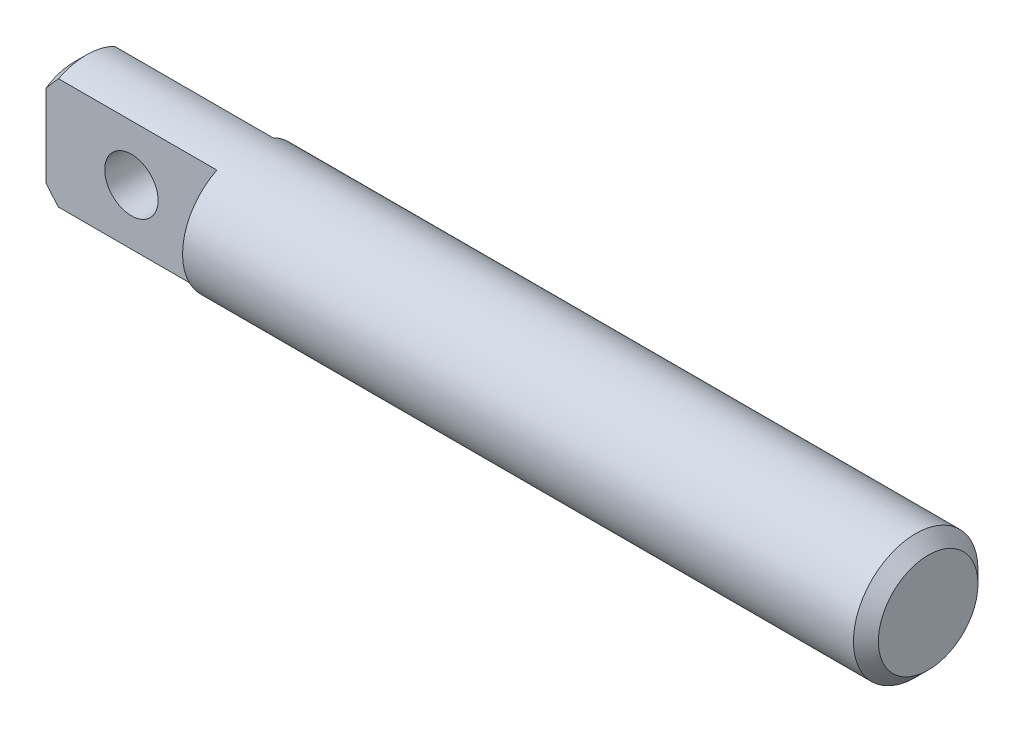
ISO-10303-21;
HEADER;
FILE_DESCRIPTION(('STEP AP214'),'2;1');
FILE_NAME('part.step','',(''),(''),'','','');
FILE_SCHEMA(('AUTOMOTIVE_DESIGN { 1 0 10303 214 1 1 1 1 }'));
ENDSEC;
DATA;
#1=APPLICATION_CONTEXT('core data for automotive mechanical design processes');
#2=APPLICATION_PROTOCOL_DEFINITION('international standard','automotive_design',2000,#1);
#3=PRODUCT_CONTEXT('',#1,'mechanical');
#4=PRODUCT('Part','Part','',(#3));
#5=PRODUCT_RELATED_PRODUCT_CATEGORY('part','',(#4));
#6=PRODUCT_DEFINITION_FORMATION('','',#4);
#7=PRODUCT_DEFINITION_CONTEXT('part definition',#1,'design');
#8=PRODUCT_DEFINITION('design','',#6,#7);
#9=PRODUCT_DEFINITION_SHAPE('','',#8);
#10=(LENGTH_UNIT() NAMED_UNIT(*) SI_UNIT(.MILLI.,.METRE.));
#11=(NAMED_UNIT(*) PLANE_ANGLE_UNIT() SI_UNIT($,.RADIAN.));
#12=(NAMED_UNIT(*) SI_UNIT($,.STERADIAN.) SOLID_ANGLE_UNIT());
#13=UNCERTAINTY_MEASURE_WITH_UNIT(LENGTH_MEASURE(1.E-05),#10,'distance_accuracy_value','');
#14=(GEOMETRIC_REPRESENTATION_CONTEXT(3) GLOBAL_UNCERTAINTY_ASSIGNED_CONTEXT((#13)) GLOBAL_UNIT_ASSIGNED_CONTEXT((#10,
#11,#12)) REPRESENTATION_CONTEXT('',''));
#15=CARTESIAN_POINT('',(0.,0.,0.));
#16=DIRECTION('',(0.,0.,1.));
#17=DIRECTION('',(1.,0.,0.));
#18=AXIS2_PLACEMENT_3D('',#15,#16,#17);
#19=CARTESIAN_POINT('',(-19.05,0.,0.));
#20=DIRECTION('',(1.,0.,0.));
#21=DIRECTION('',(0.,0.,-1.));
#22=AXIS2_PLACEMENT_3D('',#19,#20,#21);
#23=CYLINDRICAL_SURFACE('',#22,2.778125);
#24=DIRECTION('',(1.,0.,0.));
#25=VECTOR('',#24,1.);
#26=CARTESIAN_POINT('',(-19.05,-2.48094495428878,-1.25015625));
#27=LINE('',#26,#25);
#28=CARTESIAN_POINT('',(-11.43,-2.48094495428878,-1.25015625));
#29=VERTEX_POINT('',#28);
#30=CARTESIAN_POINT('',(-18.494375,-2.48094495428879,-1.25015625));
#31=VERTEX_POINT('',#30);
#32=EDGE_CURVE('E153',#29,#31,#27,.F.);
#33=ORIENTED_EDGE('',*,*,#32,.F.);
#34=CARTESIAN_POINT('',(-11.43,0.,0.));
#35=DIRECTION('',(-1.,0.,0.));
#36=DIRECTION('',(0.,0.,1.));
#37=AXIS2_PLACEMENT_3D('',#34,#35,#36);
#38=CIRCLE('',#37,2.778125);
#39=CARTESIAN_POINT('',(-11.43,2.48094495428878,-1.25015625));
#40=VERTEX_POINT('',#39);
#41=EDGE_CURVE('E11',#29,#40,#38,.F.);
#42=ORIENTED_EDGE('',*,*,#41,.T.);
#43=DIRECTION('',(1.,0.,0.));
#44=VECTOR('',#43,1.);
#45=CARTESIAN_POINT('',(-19.05,2.48094495428878,-1.25015625));
#46=LINE('',#45,#44);
#47=CARTESIAN_POINT('',(-18.494375,2.48094495428878,-1.25015625));
#48=VERTEX_POINT('',#47);
#49=EDGE_CURVE('E156',#48,#40,#46,.T.);
#50=ORIENTED_EDGE('',*,*,#49,.F.);
#51=CARTESIAN_POINT('',(-18.494375,0.,0.));
#52=DIRECTION('',(1.,0.,0.));
#53=DIRECTION('',(0.,0.,-1.));
#54=AXIS2_PLACEMENT_3D('',#51,#52,#53);
#55=CIRCLE('',#54,2.778125);
#56=CARTESIAN_POINT('',(-18.494375,2.48094495428878,1.25015625));
#57=VERTEX_POINT('',#56);
#58=EDGE_CURVE('E155',#48,#57,#55,.T.);
#59=ORIENTED_EDGE('',*,*,#58,.T.);
#60=DIRECTION('',(1.,0.,0.));
#61=VECTOR('',#60,1.);
#62=CARTESIAN_POINT('',(-19.05,2.48094495428878,1.25015625));
#63=LINE('',#62,#61);
#64=CARTESIAN_POINT('',(-11.43,2.48094495428878,1.25015625));
#65=VERTEX_POINT('',#64);
#66=EDGE_CURVE('E50',#57,#65,#63,.T.);
#67=ORIENTED_EDGE('',*,*,#66,.T.);
#68=CARTESIAN_POINT('',(-11.43,0.,0.));
#69=DIRECTION('',(-1.,0.,0.));
#70=DIRECTION('',(0.,0.,1.));
#71=AXIS2_PLACEMENT_3D('',#68,#69,#70);
#72=CIRCLE('',#71,2.778125);
#73=CARTESIAN_POINT('',(-11.43,-2.48094495428878,1.25015625));
#74=VERTEX_POINT('',#73);
#75=EDGE_CURVE('E43',#65,#74,#72,.F.);
#76=ORIENTED_EDGE('',*,*,#75,.T.);
#77=DIRECTION('',(1.,0.,0.));
#78=VECTOR('',#77,1.);
#79=CARTESIAN_POINT('',(-19.05,-2.48094495428878,1.25015625));
#80=LINE('',#79,#78);
#81=CARTESIAN_POINT('',(-18.494375,-2.48094495428879,1.25015625));
#82=VERTEX_POINT('',#81);
#83=EDGE_CURVE('E167',#74,#82,#80,.F.);
#84=ORIENTED_EDGE('',*,*,#83,.T.);
#85=EDGE_CURVE('E105',#82,#31,#55,.T.);
#86=ORIENTED_EDGE('',*,*,#85,.T.);
#87=EDGE_LOOP('',(#33,#42,#50,#59,#67,#76,#84,#86));
#88=FACE_BOUND('',#87,.T.);
#89=CARTESIAN_POINT('',(18.494375,0.,0.));
#90=DIRECTION('',(1.,0.,0.));
#91=DIRECTION('',(0.,0.,-1.));
#92=AXIS2_PLACEMENT_3D('',#89,#90,#91);
#93=CIRCLE('',#92,2.778125);
#94=CARTESIAN_POINT('',(18.494375,0.,-2.778125));
#95=VERTEX_POINT('',#94);
#96=EDGE_CURVE('E111',#95,#95,#93,.F.);
#97=ORIENTED_EDGE('',*,*,#96,.T.);
#98=EDGE_LOOP('',(#97));
#99=FACE_BOUND('',#98,.T.);
#100=ADVANCED_FACE('F33',(#88,#99),#23,.T.);
#101=CARTESIAN_POINT('',(-19.05,0.,0.));
#102=DIRECTION('',(1.,0.,0.));
#103=DIRECTION('',(0.,0.,-1.));
#104=AXIS2_PLACEMENT_3D('',#101,#102,#103);
#105=PLANE('',#104);
#106=CARTESIAN_POINT('',(-19.05,0.,0.));
#107=DIRECTION('',(1.,0.,0.));
#108=DIRECTION('',(0.,0.,-1.));
#109=AXIS2_PLACEMENT_3D('',#106,#107,#108);
#110=CIRCLE('',#109,2.22249999999998);
#111=CARTESIAN_POINT('',(-19.05,1.83755696526281,1.25015625));
#112=VERTEX_POINT('',#111);
#113=CARTESIAN_POINT('',(-19.05,1.83755696526281,-1.25015625));
#114=VERTEX_POINT('',#113);
#115=EDGE_CURVE('E109',#112,#114,#110,.F.);
#116=ORIENTED_EDGE('',*,*,#115,.T.);
#117=DIRECTION('',(0.,1.,0.));
#118=VECTOR('',#117,1.);
#119=CARTESIAN_POINT('',(-19.05,0.,-1.25015625));
#120=LINE('',#119,#118);
#121=CARTESIAN_POINT('',(-19.05,-1.83755696526281,-1.25015625));
#122=VERTEX_POINT('',#121);
#123=EDGE_CURVE('E58',#122,#114,#120,.T.);
#124=ORIENTED_EDGE('',*,*,#123,.F.);
#125=CARTESIAN_POINT('',(-19.05,-1.83755696526281,1.25015625));
#126=VERTEX_POINT('',#125);
#127=EDGE_CURVE('E103',#122,#126,#110,.F.);
#128=ORIENTED_EDGE('',*,*,#127,.T.);
#129=DIRECTION('',(0.,1.,0.));
#130=VECTOR('',#129,1.);
#131=CARTESIAN_POINT('',(-19.05,0.,1.25015625));
#132=LINE('',#131,#130);
#133=EDGE_CURVE('E87',#126,#112,#132,.T.);
#134=ORIENTED_EDGE('',*,*,#133,.T.);
#135=EDGE_LOOP('',(#116,#124,#128,#134));
#136=FACE_BOUND('',#135,.T.);
#137=ADVANCED_FACE('F108',(#136),#105,.F.);
#138=CARTESIAN_POINT('',(-18.494375,0.,0.));
#139=DIRECTION('',(1.,0.,0.));
#140=DIRECTION('',(0.,0.,-1.));
#141=AXIS2_PLACEMENT_3D('',#138,#139,#140);
#142=CONICAL_SURFACE('',#141,2.778125,0.785398163397453);
#143=CARTESIAN_POINT('',(-15.1437977148088,-5.99984175217095,-1.25015625));
#144=CARTESIAN_POINT('',(-15.2862790397768,-5.85429341591392,-1.25015625));
#145=CARTESIAN_POINT('',(-15.4286569081589,-5.70864354358459,-1.25015625));
#146=CARTESIAN_POINT('',(-15.7133798471582,-5.41682311170151,-1.25015625));
#147=CARTESIAN_POINT('',(-15.8557244414768,-5.2706520875071,-1.25015625));
#148=CARTESIAN_POINT('',(-16.1441879023591,-4.97372743920858,-1.25015625));
#149=CARTESIAN_POINT('',(-16.2902965137751,-4.8229638471388,-1.25015625));
#150=CARTESIAN_POINT('',(-16.5817765782508,-4.52122966327245,-1.25015625));
#151=CARTESIAN_POINT('',(-16.7271488696072,-4.37025988175388,-1.25015625));
#152=CARTESIAN_POINT('',(-17.0102394325332,-4.07500301138778,-1.25015625));
#153=CARTESIAN_POINT('',(-17.1479883031171,-3.93074528572952,-1.25015625));
#154=CARTESIAN_POINT('',(-17.4227104806121,-3.64143519891799,-1.25015625));
#155=CARTESIAN_POINT('',(-17.5596836195039,-3.49638267806704,-1.25015625));
#156=CARTESIAN_POINT('',(-17.8334588422059,-3.2041772952479,-1.25015625));
#157=CARTESIAN_POINT('',(-17.970252834978,-3.05701683352406,-1.25015625));
#158=CARTESIAN_POINT('',(-18.2420079038534,-2.76123238386521,-1.25015625));
#159=CARTESIAN_POINT('',(-18.376970387001,-2.61260969076958,-1.25015625));
#160=CARTESIAN_POINT('',(-18.6404909687136,-2.31710841938801,-1.25015625));
#161=CARTESIAN_POINT('',(-18.7691228070271,-2.17029620285472,-1.25015625));
#162=CARTESIAN_POINT('',(-18.958991879474,-1.94703321520391,-1.25015625));
#163=CARTESIAN_POINT('',(-19.0218685949695,-1.87197972146568,-1.25015625));
#164=CARTESIAN_POINT('',(-19.1460946981215,-1.72063600139797,-1.25015625));
#165=CARTESIAN_POINT('',(-19.2074443586556,-1.6443460001086,-1.25015625));
#166=CARTESIAN_POINT('',(-19.3271859456586,-1.49117674078092,-1.25015625));
#167=CARTESIAN_POINT('',(-19.3856071713808,-1.41432050044305,-1.25015625));
#168=CARTESIAN_POINT('',(-19.4995175988745,-1.25834186429071,-1.25015625));
#169=CARTESIAN_POINT('',(-19.5550043645846,-1.17921766719504,-1.25015625));
#170=CARTESIAN_POINT('',(-19.6611610400663,-1.01841222035611,-1.25015625));
#171=CARTESIAN_POINT('',(-19.7118561804126,-0.936747768361951,-1.25015625));
#172=CARTESIAN_POINT('',(-19.806150099985,-0.769455143806472,-1.25015625));
#173=CARTESIAN_POINT('',(-19.8497630949186,-0.683835365976064,-1.25015625));
#174=CARTESIAN_POINT('',(-19.8957672588276,-0.576878558230866,-1.25015625));
#175=CARTESIAN_POINT('',(-19.9036265446968,-0.557880759553825,-1.25015625));
#176=CARTESIAN_POINT('',(-19.918760727707,-0.519643009487904,-1.25015625));
#177=CARTESIAN_POINT('',(-19.9260353626574,-0.500402953881722,-1.25015625));
#178=CARTESIAN_POINT('',(-19.9399371557106,-0.461691454042766,-1.25015625));
#179=CARTESIAN_POINT('',(-19.9465643758775,-0.442220032190954,-1.25015625));
#180=CARTESIAN_POINT('',(-19.9591085731604,-0.403051926716749,-1.25015625));
#181=CARTESIAN_POINT('',(-19.965025594537,-0.383355257216007,-1.25015625));
#182=CARTESIAN_POINT('',(-19.981425267693,-0.324621057239181,-1.25015625));
#183=CARTESIAN_POINT('',(-19.9908024126451,-0.285265065126734,-1.25015625));
#184=CARTESIAN_POINT('',(-20.0061053904782,-0.2058675538485,-1.25015625));
#185=CARTESIAN_POINT('',(-20.0120301010957,-0.165825816120396,-1.25015625));
#186=CARTESIAN_POINT('',(-20.0201450334091,-0.084627109268307,-1.25015625));
#187=CARTESIAN_POINT('',(-20.0222659828596,-0.0434630504423657,-1.25015625));
#188=CARTESIAN_POINT('',(-20.0224172797187,0.0388598101314496,-1.25015625));
#189=CARTESIAN_POINT('',(-20.0204488451366,0.0800186097941777,-1.25015625));
#190=CARTESIAN_POINT('',(-20.0125462752103,0.162068023197748,-1.25015625));
#191=CARTESIAN_POINT('',(-20.0066006152202,0.202957507836205,-1.25015625));
#192=CARTESIAN_POINT('',(-19.991098623638,0.284052320262391,-1.25015625));
#193=CARTESIAN_POINT('',(-19.9815405492558,0.324257308018596,-1.25015625));
#194=CARTESIAN_POINT('',(-19.9546722598038,0.420364591255218,-1.25015625));
#195=CARTESIAN_POINT('',(-19.9357913949926,0.475825653001581,-1.25015625));
#196=CARTESIAN_POINT('',(-19.8932175764483,0.584855581286207,-1.25015625));
#197=CARTESIAN_POINT('',(-19.8695216270469,0.6384232453862,-1.25015625));
#198=CARTESIAN_POINT('',(-19.8183892077121,0.744109202664803,-1.25015625));
#199=CARTESIAN_POINT('',(-19.7909315083344,0.796217088746848,-1.25015625));
#200=CARTESIAN_POINT('',(-19.7333213733352,0.898878942875087,-1.25015625));
#201=CARTESIAN_POINT('',(-19.7031698995371,0.949433456963053,-1.25015625));
#202=CARTESIAN_POINT('',(-19.635813397061,1.05731038681466,-1.25015625));
#203=CARTESIAN_POINT('',(-19.5982546995845,1.1144105898051,-1.25015625));
#204=CARTESIAN_POINT('',(-19.5211229428566,1.22723966939193,-1.25015625));
#205=CARTESIAN_POINT('',(-19.4815494564534,1.28296825144709,-1.25015625));
#206=CARTESIAN_POINT('',(-19.3605371441772,1.44860273563552,-1.25015625));
#207=CARTESIAN_POINT('',(-19.2768631866064,1.55687024026319,-1.25015625));
#208=CARTESIAN_POINT('',(-19.1057754149176,1.77084512635414,-1.25015625));
#209=CARTESIAN_POINT('',(-19.0183520323055,1.87654472875925,-1.25015625));
#210=CARTESIAN_POINT('',(-18.841251456036,2.08595169134478,-1.25015625));
#211=CARTESIAN_POINT('',(-18.7515752904604,2.18965992350916,-1.25015625));
#212=CARTESIAN_POINT('',(-18.570404053475,2.39601147257986,-1.25015625));
#213=CARTESIAN_POINT('',(-18.478904396156,2.49865074475845,-1.25015625));
#214=CARTESIAN_POINT('',(-18.2947821113364,2.70293524694739,-1.25015625));
#215=CARTESIAN_POINT('',(-18.2021593632441,2.80458036805578,-1.25015625));
#216=CARTESIAN_POINT('',(-17.9233794828847,3.1080820552544,-1.25015625));
#217=CARTESIAN_POINT('',(-17.7360195386316,3.30883223760984,-1.25015625));
#218=CARTESIAN_POINT('',(-17.3489814390613,3.71968317041704,-1.25015625));
#219=CARTESIAN_POINT('',(-17.1491973269104,3.92968361954701,-1.25015625));
#220=CARTESIAN_POINT('',(-16.7482215870087,4.34854662780243,-1.25015625));
#221=CARTESIAN_POINT('',(-16.5470292751478,4.55740853139365,-1.25015625));
#222=CARTESIAN_POINT('',(-16.1457714594881,4.97224350221268,-1.25015625));
#223=CARTESIAN_POINT('',(-15.9457144004864,5.17822474993588,-1.25015625));
#224=CARTESIAN_POINT('',(-15.545100037006,5.58947955576443,-1.25015625));
#225=CARTESIAN_POINT('',(-15.3445430684227,5.79475344095209,-1.25015625));
#226=CARTESIAN_POINT('',(-15.1437977148088,5.99984175217096,-1.25015625));
#227=B_SPLINE_CURVE_WITH_KNOTS('',3,(#143,#144,#145,#146,#147,#148,#149,#150,#151,#152,#153,
#154,#155,#156,#157,#158,#159,#160,#161,#162,#163,#164,#165,#166,#167,#168,#169,#170,#171,#172,
#173,#174,#175,#176,#177,#178,#179,#180,#181,#182,#183,#184,#185,#186,#187,#188,#189,#190,#191,
#192,#193,#194,#195,#196,#197,#198,#199,#200,#201,#202,#203,#204,#205,#206,#207,#208,#209,#210,
#211,#212,#213,#214,#215,#216,#217,#218,#219,#220,#221,#222,#223,#224,#225,#226),.UNSPECIFIED.,
.F.,.F.,(4,2,2,2,2,2,2,2,2,2,2,2,2,2,2,2,2,2,2,2,2,2,2,2,2,2,2,2,2,2,2,2,2,2,2,2,2,2,2,2,2,4),
(0.,0.611038043473178,1.22312552284303,1.85296316203927,2.4817103627987,3.08009374155775,
3.67860211739569,4.28135190018361,4.88360891435237,5.46912442312643,5.76284295974228,
6.05650862783671,6.34608292004141,6.63589394769863,6.92408229288897,7.21168482090683,
7.27335488653124,7.33505245595278,7.39674410494345,7.4584319072204,7.57965979426724,
7.70092706623351,7.82438119869177,7.94779856602356,8.07157511302299,8.1954114517396,
8.37085840481207,8.54641484691382,8.72300632278922,8.89953499602617,9.10451114724297,
9.30953093754362,9.71988193913639,10.1313509868088,10.5426355502399,10.9551335764975,
11.3676762938872,12.1914477094953,13.0609955197722,13.9310000094643,14.7924276980098,
15.6533813105829),.UNSPECIFIED.);
#228=EDGE_CURVE('E166',#31,#122,#227,.T.);
#229=ORIENTED_EDGE('',*,*,#228,.F.);
#230=ORIENTED_EDGE('',*,*,#85,.F.);
#231=CARTESIAN_POINT('',(-15.1437977148088,-5.99984175217096,1.25015625));
#232=CARTESIAN_POINT('',(-15.2862790397768,-5.85429341591392,1.25015625));
#233=CARTESIAN_POINT('',(-15.4286569081589,-5.70864354358459,1.25015625));
#234=CARTESIAN_POINT('',(-15.7133798471582,-5.41682311170151,1.25015625));
#235=CARTESIAN_POINT('',(-15.8557244414768,-5.2706520875071,1.25015625));
#236=CARTESIAN_POINT('',(-16.1441879023591,-4.97372743920858,1.25015625));
#237=CARTESIAN_POINT('',(-16.2902965137751,-4.8229638471388,1.25015625));
#238=CARTESIAN_POINT('',(-16.5817765782508,-4.52122966327245,1.25015625));
#239=CARTESIAN_POINT('',(-16.7271488696072,-4.37025988175388,1.25015625));
#240=CARTESIAN_POINT('',(-17.0102394325332,-4.07500301138778,1.25015625));
#241=CARTESIAN_POINT('',(-17.1479883031171,-3.93074528572952,1.25015625));
#242=CARTESIAN_POINT('',(-17.4227104806121,-3.64143519891799,1.25015625));
#243=CARTESIAN_POINT('',(-17.5596836195039,-3.49638267806705,1.25015625));
#244=CARTESIAN_POINT('',(-17.8334588422059,-3.2041772952479,1.25015625));
#245=CARTESIAN_POINT('',(-17.970252834978,-3.05701683352406,1.25015625));
#246=CARTESIAN_POINT('',(-18.2420079038534,-2.76123238386521,1.25015625));
#247=CARTESIAN_POINT('',(-18.3769703870009,-2.61260969076958,1.25015625));
#248=CARTESIAN_POINT('',(-18.6404909687136,-2.31710841938801,1.25015625));
#249=CARTESIAN_POINT('',(-18.7691228070271,-2.17029620285472,1.25015625));
#250=CARTESIAN_POINT('',(-18.958991879474,-1.94703321520392,1.25015625));
#251=CARTESIAN_POINT('',(-19.0218685949695,-1.87197972146568,1.25015625));
#252=CARTESIAN_POINT('',(-19.1460946981215,-1.72063600139797,1.25015625));
#253=CARTESIAN_POINT('',(-19.2074443586556,-1.6443460001086,1.25015625));
#254=CARTESIAN_POINT('',(-19.3271859456586,-1.49117674078092,1.25015625));
#255=CARTESIAN_POINT('',(-19.3856071713808,-1.41432050044305,1.25015625));
#256=CARTESIAN_POINT('',(-19.4995175988745,-1.25834186429071,1.25015625));
#257=CARTESIAN_POINT('',(-19.5550043645846,-1.17921766719504,1.25015625));
#258=CARTESIAN_POINT('',(-19.6611610400663,-1.01841222035611,1.25015625));
#259=CARTESIAN_POINT('',(-19.7118561804126,-0.936747768361952,1.25015625));
#260=CARTESIAN_POINT('',(-19.806150099985,-0.769455143806473,1.25015625));
#261=CARTESIAN_POINT('',(-19.8497630949186,-0.683835365976065,1.25015625));
#262=CARTESIAN_POINT('',(-19.8957672588276,-0.576878558230868,1.25015625));
#263=CARTESIAN_POINT('',(-19.9036265446968,-0.557880759553826,1.25015625));
#264=CARTESIAN_POINT('',(-19.918760727707,-0.519643009487904,1.25015625));
#265=CARTESIAN_POINT('',(-19.9260353626574,-0.500402953881723,1.25015625));
#266=CARTESIAN_POINT('',(-19.9399371557106,-0.461691454042766,1.25015625));
#267=CARTESIAN_POINT('',(-19.9465643758775,-0.442220032190954,1.25015625));
#268=CARTESIAN_POINT('',(-19.9591085731604,-0.40305192671675,1.25015625));
#269=CARTESIAN_POINT('',(-19.965025594537,-0.383355257216008,1.25015625));
#270=CARTESIAN_POINT('',(-19.981425267693,-0.324621057239182,1.25015625));
#271=CARTESIAN_POINT('',(-19.9908024126451,-0.285265065126735,1.25015625));
#272=CARTESIAN_POINT('',(-20.0061053904782,-0.205867553848501,1.25015625));
#273=CARTESIAN_POINT('',(-20.0120301010957,-0.165825816120397,1.25015625));
#274=CARTESIAN_POINT('',(-20.0201450334091,-0.0846271092683084,1.25015625));
#275=CARTESIAN_POINT('',(-20.0222659828596,-0.0434630504423669,1.25015625));
#276=CARTESIAN_POINT('',(-20.0224172797187,0.0388598101314483,1.25015625));
#277=CARTESIAN_POINT('',(-20.0204488451366,0.0800186097941761,1.25015625));
#278=CARTESIAN_POINT('',(-20.0125462752103,0.162068023197746,1.25015625));
#279=CARTESIAN_POINT('',(-20.0066006152202,0.202957507836204,1.25015625));
#280=CARTESIAN_POINT('',(-19.991098623638,0.284052320262389,1.25015625));
#281=CARTESIAN_POINT('',(-19.9815405492558,0.324257308018595,1.25015625));
#282=CARTESIAN_POINT('',(-19.9546722598038,0.420364591255217,1.25015625));
#283=CARTESIAN_POINT('',(-19.9357913949926,0.475825653001579,1.25015625));
#284=CARTESIAN_POINT('',(-19.8932175764483,0.584855581286205,1.25015625));
#285=CARTESIAN_POINT('',(-19.8695216270469,0.638423245386198,1.25015625));
#286=CARTESIAN_POINT('',(-19.8183892077121,0.7441092026648,1.25015625));
#287=CARTESIAN_POINT('',(-19.7909315083344,0.796217088746846,1.25015625));
#288=CARTESIAN_POINT('',(-19.7333213733352,0.898878942875085,1.25015625));
#289=CARTESIAN_POINT('',(-19.7031698995371,0.949433456963051,1.25015625));
#290=CARTESIAN_POINT('',(-19.635813397061,1.05731038681466,1.25015625));
#291=CARTESIAN_POINT('',(-19.5982546995845,1.1144105898051,1.25015625));
#292=CARTESIAN_POINT('',(-19.5211229428566,1.22723966939193,1.25015625));
#293=CARTESIAN_POINT('',(-19.4815494564534,1.28296825144709,1.25015625));
#294=CARTESIAN_POINT('',(-19.3605371441772,1.44860273563552,1.25015625));
#295=CARTESIAN_POINT('',(-19.2768631866064,1.55687024026318,1.25015625));
#296=CARTESIAN_POINT('',(-19.1057754149176,1.77084512635413,1.25015625));
#297=CARTESIAN_POINT('',(-19.0183520323055,1.87654472875924,1.25015625));
#298=CARTESIAN_POINT('',(-18.841251456036,2.08595169134477,1.25015625));
#299=CARTESIAN_POINT('',(-18.7515752904605,2.18965992350915,1.25015625));
#300=CARTESIAN_POINT('',(-18.570404053475,2.39601147257985,1.25015625));
#301=CARTESIAN_POINT('',(-18.4789043961561,2.49865074475844,1.25015625));
#302=CARTESIAN_POINT('',(-18.2947821113364,2.70293524694738,1.25015625));
#303=CARTESIAN_POINT('',(-18.2021593632441,2.80458036805577,1.25015625));
#304=CARTESIAN_POINT('',(-17.9233794828847,3.10808205525439,1.25015625));
#305=CARTESIAN_POINT('',(-17.7360195386316,3.30883223760983,1.25015625));
#306=CARTESIAN_POINT('',(-17.3489814390613,3.71968317041702,1.25015625));
#307=CARTESIAN_POINT('',(-17.1491973269104,3.929683619547,1.25015625));
#308=CARTESIAN_POINT('',(-16.7482215870087,4.34854662780242,1.25015625));
#309=CARTESIAN_POINT('',(-16.5470292751478,4.55740853139364,1.25015625));
#310=CARTESIAN_POINT('',(-16.1457714594882,4.97224350221268,1.25015625));
#311=CARTESIAN_POINT('',(-15.9457144004864,5.17822474993588,1.25015625));
#312=CARTESIAN_POINT('',(-15.545100037006,5.58947955576443,1.25015625));
#313=CARTESIAN_POINT('',(-15.3445430684227,5.79475344095209,1.25015625));
#314=CARTESIAN_POINT('',(-15.1437977148088,5.99984175217096,1.25015625));
#315=B_SPLINE_CURVE_WITH_KNOTS('',3,(#231,#232,#233,#234,#235,#236,#237,#238,#239,#240,#241,
#242,#243,#244,#245,#246,#247,#248,#249,#250,#251,#252,#253,#254,#255,#256,#257,#258,#259,#260,
#261,#262,#263,#264,#265,#266,#267,#268,#269,#270,#271,#272,#273,#274,#275,#276,#277,#278,#279,
#280,#281,#282,#283,#284,#285,#286,#287,#288,#289,#290,#291,#292,#293,#294,#295,#296,#297,#298,
#299,#300,#301,#302,#303,#304,#305,#306,#307,#308,#309,#310,#311,#312,#313,#314),.UNSPECIFIED.,
.F.,.F.,(4,2,2,2,2,2,2,2,2,2,2,2,2,2,2,2,2,2,2,2,2,2,2,2,2,2,2,2,2,2,2,2,2,2,2,2,2,2,2,2,2,4),
(0.,0.611038043473179,1.22312552284303,1.85296316203926,2.48171036279869,3.08009374155774,
3.67860211739569,4.28135190018361,4.88360891435237,5.46912442312643,5.76284295974227,
6.0565086278367,6.3460829200414,6.63589394769863,6.92408229288897,7.21168482090682,
7.27335488653124,7.33505245595278,7.39674410494345,7.4584319072204,7.57965979426724,
7.70092706623351,7.82438119869176,7.94779856602355,8.07157511302298,8.1954114517396,
8.37085840481206,8.54641484691382,8.72300632278921,8.89953499602617,9.10451114724296,
9.30953093754361,9.71988193913638,10.1313509868088,10.5426355502399,10.9551335764975,
11.3676762938872,12.1914477094953,13.0609955197722,13.9310000094643,14.7924276980098,
15.6533813105829),.UNSPECIFIED.);
#316=EDGE_CURVE('E90',#82,#126,#315,.T.);
#317=ORIENTED_EDGE('',*,*,#316,.T.);
#318=ORIENTED_EDGE('',*,*,#127,.F.);
#319=EDGE_LOOP('',(#229,#230,#317,#318));
#320=FACE_BOUND('',#319,.T.);
#321=ADVANCED_FACE('F35',(#320),#142,.T.);
#322=EDGE_CURVE('E106',#114,#48,#227,.T.);
#323=ORIENTED_EDGE('',*,*,#322,.F.);
#324=ORIENTED_EDGE('',*,*,#115,.F.);
#325=EDGE_CURVE('E92',#112,#57,#315,.T.);
#326=ORIENTED_EDGE('',*,*,#325,.T.);
#327=ORIENTED_EDGE('',*,*,#58,.F.);
#328=EDGE_LOOP('',(#323,#324,#326,#327));
#329=FACE_BOUND('',#328,.T.);
#330=ADVANCED_FACE('F136',(#329),#142,.T.);
#331=CARTESIAN_POINT('',(19.05,0.,0.));
#332=DIRECTION('',(1.,0.,0.));
#333=DIRECTION('',(0.,0.,-1.));
#334=AXIS2_PLACEMENT_3D('',#331,#332,#333);
#335=PLANE('',#334);
#336=CARTESIAN_POINT('',(19.05,0.,0.));
#337=DIRECTION('',(1.,0.,0.));
#338=DIRECTION('',(0.,0.,-1.));
#339=AXIS2_PLACEMENT_3D('',#336,#337,#338);
#340=CIRCLE('',#339,2.22249999999999);
#341=CARTESIAN_POINT('',(19.05,0.,-2.22249999999999));
#342=VERTEX_POINT('',#341);
#343=EDGE_CURVE('E152',#342,#342,#340,.T.);
#344=ORIENTED_EDGE('',*,*,#343,.T.);
#345=EDGE_LOOP('',(#344));
#346=FACE_BOUND('',#345,.T.);
#347=ADVANCED_FACE('F133',(#346),#335,.T.);
#348=CARTESIAN_POINT('',(19.05,0.,0.));
#349=DIRECTION('',(-1.,0.,0.));
#350=DIRECTION('',(0.,0.,1.));
#351=AXIS2_PLACEMENT_3D('',#348,#349,#350);
#352=CONICAL_SURFACE('',#351,2.22249999999999,0.785398163397456);
#353=ORIENTED_EDGE('',*,*,#96,.F.);
#354=EDGE_LOOP('',(#353));
#355=FACE_BOUND('',#354,.T.);
#356=ORIENTED_EDGE('',*,*,#343,.F.);
#357=EDGE_LOOP('',(#356));
#358=FACE_BOUND('',#357,.T.);
#359=ADVANCED_FACE('F131',(#355,#358),#352,.T.);
#360=CARTESIAN_POINT('',(-11.43,0.,1.25015625));
#361=DIRECTION('',(0.,0.,1.));
#362=DIRECTION('',(1.,0.,0.));
#363=AXIS2_PLACEMENT_3D('',#360,#361,#362);
#364=PLANE('',#363);
#365=CARTESIAN_POINT('',(-15.24,0.,1.25015625));
#366=DIRECTION('',(0.,0.,1.));
#367=DIRECTION('',(1.,0.,0.));
#368=AXIS2_PLACEMENT_3D('',#365,#366,#367);
#369=CIRCLE('',#368,1.190625);
#370=CARTESIAN_POINT('',(-14.049375,0.,1.25015625));
#371=VERTEX_POINT('',#370);
#372=EDGE_CURVE('E182',#371,#371,#369,.T.);
#373=ORIENTED_EDGE('',*,*,#372,.F.);
#374=EDGE_LOOP('',(#373));
#375=FACE_BOUND('',#374,.T.);
#376=DIRECTION('',(0.,1.,0.));
#377=VECTOR('',#376,1.);
#378=CARTESIAN_POINT('',(-11.43,0.,1.25015625));
#379=LINE('',#378,#377);
#380=EDGE_CURVE('E97',#74,#65,#379,.T.);
#381=ORIENTED_EDGE('',*,*,#380,.T.);
#382=ORIENTED_EDGE('',*,*,#66,.F.);
#383=ORIENTED_EDGE('',*,*,#325,.F.);
#384=ORIENTED_EDGE('',*,*,#133,.F.);
#385=ORIENTED_EDGE('',*,*,#316,.F.);
#386=ORIENTED_EDGE('',*,*,#83,.F.);
#387=EDGE_LOOP('',(#381,#382,#383,#384,#385,#386));
#388=FACE_BOUND('',#387,.T.);
#389=ADVANCED_FACE('F89',(#375,#388),#364,.T.);
#390=CARTESIAN_POINT('',(-11.43,0.,0.));
#391=DIRECTION('',(-1.,0.,0.));
#392=DIRECTION('',(0.,0.,1.));
#393=AXIS2_PLACEMENT_3D('',#390,#391,#392);
#394=PLANE('',#393);
#395=ORIENTED_EDGE('',*,*,#380,.F.);
#396=ORIENTED_EDGE('',*,*,#75,.F.);
#397=EDGE_LOOP('',(#395,#396));
#398=FACE_BOUND('',#397,.T.);
#399=ADVANCED_FACE('F130',(#398),#394,.T.);
#400=CARTESIAN_POINT('',(-11.43,0.,-1.25015625));
#401=DIRECTION('',(0.,0.,1.));
#402=DIRECTION('',(1.,0.,0.));
#403=AXIS2_PLACEMENT_3D('',#400,#401,#402);
#404=PLANE('',#403);
#405=CARTESIAN_POINT('',(-15.24,0.,-1.25015625));
#406=DIRECTION('',(0.,0.,1.));
#407=DIRECTION('',(1.,0.,0.));
#408=AXIS2_PLACEMENT_3D('',#405,#406,#407);
#409=CIRCLE('',#408,1.190625);
#410=CARTESIAN_POINT('',(-14.049375,0.,-1.25015625));
#411=VERTEX_POINT('',#410);
#412=EDGE_CURVE('E38',#411,#411,#409,.T.);
#413=ORIENTED_EDGE('',*,*,#412,.T.);
#414=EDGE_LOOP('',(#413));
#415=FACE_BOUND('',#414,.T.);
#416=ORIENTED_EDGE('',*,*,#32,.T.);
#417=ORIENTED_EDGE('',*,*,#228,.T.);
#418=ORIENTED_EDGE('',*,*,#123,.T.);
#419=ORIENTED_EDGE('',*,*,#322,.T.);
#420=ORIENTED_EDGE('',*,*,#49,.T.);
#421=DIRECTION('',(0.,1.,0.));
#422=VECTOR('',#421,1.);
#423=CARTESIAN_POINT('',(-11.43,0.,-1.25015625));
#424=LINE('',#423,#422);
#425=EDGE_CURVE('E171',#29,#40,#424,.T.);
#426=ORIENTED_EDGE('',*,*,#425,.F.);
#427=EDGE_LOOP('',(#416,#417,#418,#419,#420,#426));
#428=FACE_BOUND('',#427,.T.);
#429=ADVANCED_FACE('F178',(#415,#428),#404,.F.);
#430=CARTESIAN_POINT('',(-11.43,0.,0.));
#431=DIRECTION('',(-1.,0.,0.));
#432=DIRECTION('',(0.,0.,1.));
#433=AXIS2_PLACEMENT_3D('',#430,#431,#432);
#434=PLANE('',#433);
#435=ORIENTED_EDGE('',*,*,#425,.T.);
#436=ORIENTED_EDGE('',*,*,#41,.F.);
#437=EDGE_LOOP('',(#435,#436));
#438=FACE_BOUND('',#437,.T.);
#439=ADVANCED_FACE('F180',(#438),#434,.T.);
#440=CARTESIAN_POINT('',(-15.24,0.,-2.778125));
#441=DIRECTION('',(0.,0.,1.));
#442=DIRECTION('',(1.,0.,0.));
#443=AXIS2_PLACEMENT_3D('',#440,#441,#442);
#444=CYLINDRICAL_SURFACE('',#443,1.190625);
#445=ORIENTED_EDGE('',*,*,#372,.T.);
#446=EDGE_LOOP('',(#445));
#447=FACE_BOUND('',#446,.T.);
#448=ORIENTED_EDGE('',*,*,#412,.F.);
#449=EDGE_LOOP('',(#448));
#450=FACE_BOUND('',#449,.T.);
#451=ADVANCED_FACE('F190',(#447,#450),#444,.F.);
#452=CLOSED_SHELL('',(#100,#137,#321,#330,#347,#359,#389,#399,#429,#439,#451));
#453=MANIFOLD_SOLID_BREP('B2',#452);
#454=ADVANCED_BREP_SHAPE_REPRESENTATION('',(#18,#453),#14);
#455=SHAPE_DEFINITION_REPRESENTATION(#9,#454);
ENDSEC;
END-ISO-10303-21;
